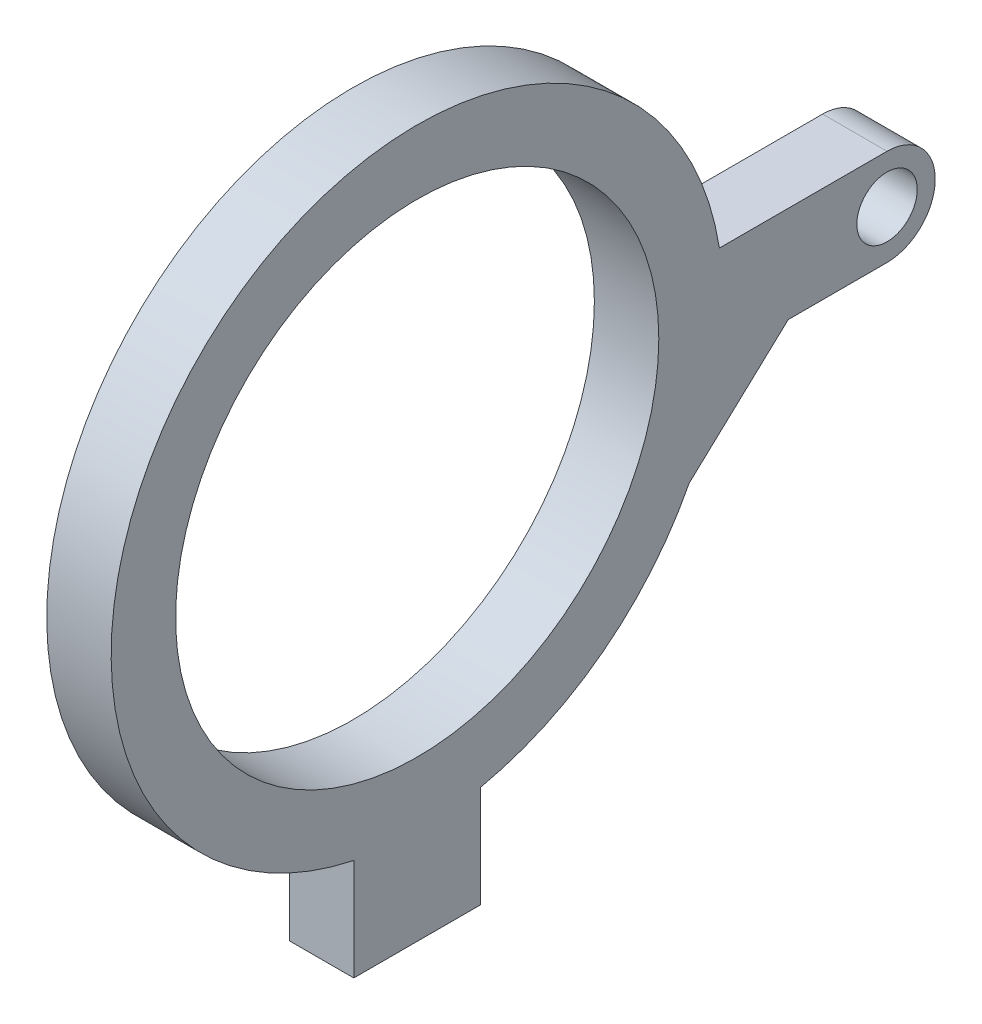
ISO-10303-21;
HEADER;
FILE_DESCRIPTION(('STEP AP214'),'2;1');
FILE_NAME('part.step','',(''),(''),'','','');
FILE_SCHEMA(('AUTOMOTIVE_DESIGN { 1 0 10303 214 1 1 1 1 }'));
ENDSEC;
DATA;
#1=APPLICATION_CONTEXT('core data for automotive mechanical design processes');
#2=APPLICATION_PROTOCOL_DEFINITION('international standard','automotive_design',2000,#1);
#3=PRODUCT_CONTEXT('',#1,'mechanical');
#4=PRODUCT('Part','Part','',(#3));
#5=PRODUCT_RELATED_PRODUCT_CATEGORY('part','',(#4));
#6=PRODUCT_DEFINITION_FORMATION('','',#4);
#7=PRODUCT_DEFINITION_CONTEXT('part definition',#1,'design');
#8=PRODUCT_DEFINITION('design','',#6,#7);
#9=PRODUCT_DEFINITION_SHAPE('','',#8);
#10=(LENGTH_UNIT() NAMED_UNIT(*) SI_UNIT(.MILLI.,.METRE.));
#11=(NAMED_UNIT(*) PLANE_ANGLE_UNIT() SI_UNIT($,.RADIAN.));
#12=(NAMED_UNIT(*) SI_UNIT($,.STERADIAN.) SOLID_ANGLE_UNIT());
#13=UNCERTAINTY_MEASURE_WITH_UNIT(LENGTH_MEASURE(1.E-05),#10,'distance_accuracy_value','');
#14=(GEOMETRIC_REPRESENTATION_CONTEXT(3) GLOBAL_UNCERTAINTY_ASSIGNED_CONTEXT((#13)) GLOBAL_UNIT_ASSIGNED_CONTEXT((#10,
#11,#12)) REPRESENTATION_CONTEXT('',''));
#15=CARTESIAN_POINT('',(0.,0.,0.));
#16=DIRECTION('',(0.,0.,1.));
#17=DIRECTION('',(1.,0.,0.));
#18=AXIS2_PLACEMENT_3D('',#15,#16,#17);
#19=CARTESIAN_POINT('',(25.4,316.3,0.));
#20=DIRECTION('',(-1.,0.,0.));
#21=DIRECTION('',(0.,0.,1.));
#22=AXIS2_PLACEMENT_3D('',#19,#20,#21);
#23=CYLINDRICAL_SURFACE('',#22,241.3);
#24=CARTESIAN_POINT('',(-25.4,316.3,0.));
#25=DIRECTION('',(1.,0.,0.));
#26=DIRECTION('',(0.,0.,-1.));
#27=AXIS2_PLACEMENT_3D('',#24,#25,#26);
#28=CIRCLE('',#27,241.3);
#29=CARTESIAN_POINT('',(-25.4,80.2371058382957,-50.));
#30=VERTEX_POINT('',#29);
#31=CARTESIAN_POINT('',(-25.4,205.638095374301,-214.42861950918));
#32=VERTEX_POINT('',#31);
#33=EDGE_CURVE('E223',#30,#32,#28,.T.);
#34=ORIENTED_EDGE('',*,*,#33,.T.);
#35=DIRECTION('',(-1.,0.,0.));
#36=VECTOR('',#35,1.);
#37=CARTESIAN_POINT('',(25.4,205.638095374301,-214.42861950918));
#38=LINE('',#37,#36);
#39=CARTESIAN_POINT('',(25.4,205.638095374301,-214.42861950918));
#40=VERTEX_POINT('',#39);
#41=EDGE_CURVE('E89',#32,#40,#38,.F.);
#42=ORIENTED_EDGE('',*,*,#41,.T.);
#43=CARTESIAN_POINT('',(25.4,316.3,0.));
#44=DIRECTION('',(1.,0.,0.));
#45=DIRECTION('',(0.,0.,-1.));
#46=AXIS2_PLACEMENT_3D('',#43,#44,#45);
#47=CIRCLE('',#46,241.3);
#48=CARTESIAN_POINT('',(25.4,80.2371058382957,-50.));
#49=VERTEX_POINT('',#48);
#50=EDGE_CURVE('E196',#49,#40,#47,.T.);
#51=ORIENTED_EDGE('',*,*,#50,.F.);
#52=DIRECTION('',(-1.,0.,0.));
#53=VECTOR('',#52,1.);
#54=CARTESIAN_POINT('',(25.4,80.2371058382957,-50.));
#55=LINE('',#54,#53);
#56=EDGE_CURVE('E190',#49,#30,#55,.T.);
#57=ORIENTED_EDGE('',*,*,#56,.T.);
#58=EDGE_LOOP('',(#34,#42,#51,#57));
#59=FACE_BOUND('',#58,.T.);
#60=ADVANCED_FACE('F66',(#59),#23,.T.);
#61=CARTESIAN_POINT('',(25.4,0.,50.));
#62=DIRECTION('',(0.,0.,1.));
#63=DIRECTION('',(0.,-1.,0.));
#64=AXIS2_PLACEMENT_3D('',#61,#62,#63);
#65=PLANE('',#64);
#66=DIRECTION('',(0.,1.,0.));
#67=VECTOR('',#66,1.);
#68=CARTESIAN_POINT('',(-25.4,0.,50.));
#69=LINE('',#68,#67);
#70=CARTESIAN_POINT('',(-25.4,0.,50.));
#71=VERTEX_POINT('',#70);
#72=CARTESIAN_POINT('',(-25.4,80.2371058382957,50.));
#73=VERTEX_POINT('',#72);
#74=EDGE_CURVE('E191',#71,#73,#69,.T.);
#75=ORIENTED_EDGE('',*,*,#74,.F.);
#76=DIRECTION('',(-1.,0.,0.));
#77=VECTOR('',#76,1.);
#78=CARTESIAN_POINT('',(25.4,0.,50.));
#79=LINE('',#78,#77);
#80=CARTESIAN_POINT('',(25.4,0.,50.));
#81=VERTEX_POINT('',#80);
#82=EDGE_CURVE('E208',#81,#71,#79,.T.);
#83=ORIENTED_EDGE('',*,*,#82,.F.);
#84=DIRECTION('',(0.,1.,0.));
#85=VECTOR('',#84,1.);
#86=CARTESIAN_POINT('',(25.4,0.,50.));
#87=LINE('',#86,#85);
#88=CARTESIAN_POINT('',(25.4,80.2371058382957,50.));
#89=VERTEX_POINT('',#88);
#90=EDGE_CURVE('E179',#81,#89,#87,.T.);
#91=ORIENTED_EDGE('',*,*,#90,.T.);
#92=DIRECTION('',(-1.,0.,0.));
#93=VECTOR('',#92,1.);
#94=CARTESIAN_POINT('',(25.4,80.2371058382957,50.));
#95=LINE('',#94,#93);
#96=EDGE_CURVE('E211',#89,#73,#95,.T.);
#97=ORIENTED_EDGE('',*,*,#96,.T.);
#98=EDGE_LOOP('',(#75,#83,#91,#97));
#99=FACE_BOUND('',#98,.T.);
#100=ADVANCED_FACE('F241',(#99),#65,.T.);
#101=CARTESIAN_POINT('',(25.4,0.,0.));
#102=DIRECTION('',(0.,1.,0.));
#103=DIRECTION('',(0.,0.,1.));
#104=AXIS2_PLACEMENT_3D('',#101,#102,#103);
#105=PLANE('',#104);
#106=DIRECTION('',(0.,0.,-1.));
#107=VECTOR('',#106,1.);
#108=CARTESIAN_POINT('',(-25.4,0.,0.));
#109=LINE('',#108,#107);
#110=CARTESIAN_POINT('',(-25.4,0.,-50.));
#111=VERTEX_POINT('',#110);
#112=EDGE_CURVE('E195',#71,#111,#109,.T.);
#113=ORIENTED_EDGE('',*,*,#112,.T.);
#114=DIRECTION('',(-1.,0.,0.));
#115=VECTOR('',#114,1.);
#116=CARTESIAN_POINT('',(25.4,0.,-50.));
#117=LINE('',#116,#115);
#118=CARTESIAN_POINT('',(25.4,0.,-50.));
#119=VERTEX_POINT('',#118);
#120=EDGE_CURVE('E204',#119,#111,#117,.T.);
#121=ORIENTED_EDGE('',*,*,#120,.F.);
#122=DIRECTION('',(0.,0.,-1.));
#123=VECTOR('',#122,1.);
#124=CARTESIAN_POINT('',(25.4,0.,0.));
#125=LINE('',#124,#123);
#126=EDGE_CURVE('E183',#81,#119,#125,.T.);
#127=ORIENTED_EDGE('',*,*,#126,.F.);
#128=ORIENTED_EDGE('',*,*,#82,.T.);
#129=EDGE_LOOP('',(#113,#121,#127,#128));
#130=FACE_BOUND('',#129,.T.);
#131=ADVANCED_FACE('F249',(#130),#105,.F.);
#132=CARTESIAN_POINT('',(25.4,0.,-50.));
#133=DIRECTION('',(0.,0.,1.));
#134=DIRECTION('',(0.,-1.,0.));
#135=AXIS2_PLACEMENT_3D('',#132,#133,#134);
#136=PLANE('',#135);
#137=DIRECTION('',(0.,1.,0.));
#138=VECTOR('',#137,1.);
#139=CARTESIAN_POINT('',(-25.4,0.,-50.));
#140=LINE('',#139,#138);
#141=EDGE_CURVE('E184',#111,#30,#140,.T.);
#142=ORIENTED_EDGE('',*,*,#141,.T.);
#143=ORIENTED_EDGE('',*,*,#56,.F.);
#144=DIRECTION('',(0.,1.,0.));
#145=VECTOR('',#144,1.);
#146=CARTESIAN_POINT('',(25.4,0.,-50.));
#147=LINE('',#146,#145);
#148=EDGE_CURVE('E187',#119,#49,#147,.T.);
#149=ORIENTED_EDGE('',*,*,#148,.F.);
#150=ORIENTED_EDGE('',*,*,#120,.T.);
#151=EDGE_LOOP('',(#142,#143,#149,#150));
#152=FACE_BOUND('',#151,.T.);
#153=ADVANCED_FACE('F253',(#152),#136,.F.);
#154=CARTESIAN_POINT('',(-25.4,0.,0.));
#155=DIRECTION('',(1.,0.,0.));
#156=DIRECTION('',(0.,0.,-1.));
#157=AXIS2_PLACEMENT_3D('',#154,#155,#156);
#158=PLANE('',#157);
#159=ORIENTED_EDGE('',*,*,#74,.T.);
#160=CARTESIAN_POINT('',(-25.4,354.3,-238.289089133347));
#161=VERTEX_POINT('',#160);
#162=EDGE_CURVE('E218',#161,#73,#28,.T.);
#163=ORIENTED_EDGE('',*,*,#162,.F.);
#164=DIRECTION('',(0.,0.,-1.));
#165=VECTOR('',#164,1.);
#166=CARTESIAN_POINT('',(-25.4,354.3,-1.48813502485077E-13));
#167=LINE('',#166,#165);
#168=CARTESIAN_POINT('',(-25.4,354.3,-370.451833459635));
#169=VERTEX_POINT('',#168);
#170=EDGE_CURVE('E256',#161,#169,#167,.T.);
#171=ORIENTED_EDGE('',*,*,#170,.T.);
#172=CARTESIAN_POINT('',(-25.4,316.3,-370.451833459635));
#173=DIRECTION('',(1.,0.,0.));
#174=DIRECTION('',(0.,0.,-1.));
#175=AXIS2_PLACEMENT_3D('',#172,#173,#174);
#176=CIRCLE('',#175,37.9999999999999);
#177=CARTESIAN_POINT('',(-25.4,278.3,-370.451833459635));
#178=VERTEX_POINT('',#177);
#179=EDGE_CURVE('E263',#178,#169,#176,.T.);
#180=ORIENTED_EDGE('',*,*,#179,.F.);
#181=DIRECTION('',(0.,0.,-1.));
#182=VECTOR('',#181,1.);
#183=CARTESIAN_POINT('',(-25.4,278.3,1.16891893145913E-13));
#184=LINE('',#183,#182);
#185=CARTESIAN_POINT('',(-25.4,278.3,-292.514595077201));
#186=VERTEX_POINT('',#185);
#187=EDGE_CURVE('E165',#186,#178,#184,.T.);
#188=ORIENTED_EDGE('',*,*,#187,.F.);
#189=DIRECTION('',(0.,-0.681223492092218,0.732075511010773));
#190=VECTOR('',#189,1.);
#191=CARTESIAN_POINT('',(-25.4,3.27149960574123,3.04425206455043));
#192=LINE('',#191,#190);
#193=EDGE_CURVE('E76',#186,#32,#192,.T.);
#194=ORIENTED_EDGE('',*,*,#193,.T.);
#195=ORIENTED_EDGE('',*,*,#33,.F.);
#196=ORIENTED_EDGE('',*,*,#141,.F.);
#197=ORIENTED_EDGE('',*,*,#112,.F.);
#198=EDGE_LOOP('',(#159,#163,#171,#180,#188,#194,#195,#196,#197));
#199=FACE_BOUND('',#198,.T.);
#200=CARTESIAN_POINT('',(-25.4,316.3,0.));
#201=DIRECTION('',(1.,0.,0.));
#202=DIRECTION('',(0.,0.,-1.));
#203=AXIS2_PLACEMENT_3D('',#200,#201,#202);
#204=CIRCLE('',#203,190.5);
#205=CARTESIAN_POINT('',(-25.4,316.3,-190.5));
#206=VERTEX_POINT('',#205);
#207=EDGE_CURVE('E168',#206,#206,#204,.T.);
#208=ORIENTED_EDGE('',*,*,#207,.T.);
#209=EDGE_LOOP('',(#208));
#210=FACE_BOUND('',#209,.T.);
#211=CARTESIAN_POINT('',(-25.4,316.3,-370.451833459635));
#212=DIRECTION('',(1.,0.,0.));
#213=DIRECTION('',(0.,0.,-1.));
#214=AXIS2_PLACEMENT_3D('',#211,#212,#213);
#215=CIRCLE('',#214,23.8216556260493);
#216=CARTESIAN_POINT('',(-25.4,316.3,-394.273489085684));
#217=VERTEX_POINT('',#216);
#218=EDGE_CURVE('E268',#217,#217,#215,.T.);
#219=ORIENTED_EDGE('',*,*,#218,.T.);
#220=EDGE_LOOP('',(#219));
#221=FACE_BOUND('',#220,.T.);
#222=ADVANCED_FACE('F244',(#199,#210,#221),#158,.F.);
#223=CARTESIAN_POINT('',(25.4,0.,0.));
#224=DIRECTION('',(1.,0.,0.));
#225=DIRECTION('',(0.,0.,-1.));
#226=AXIS2_PLACEMENT_3D('',#223,#224,#225);
#227=PLANE('',#226);
#228=ORIENTED_EDGE('',*,*,#148,.T.);
#229=ORIENTED_EDGE('',*,*,#50,.T.);
#230=DIRECTION('',(0.,0.681223492092218,-0.732075511010773));
#231=VECTOR('',#230,1.);
#232=CARTESIAN_POINT('',(25.4,278.3,-292.514595077201));
#233=LINE('',#232,#231);
#234=CARTESIAN_POINT('',(25.4,278.3,-292.514595077201));
#235=VERTEX_POINT('',#234);
#236=EDGE_CURVE('E12',#40,#235,#233,.T.);
#237=ORIENTED_EDGE('',*,*,#236,.T.);
#238=DIRECTION('',(0.,0.,-1.));
#239=VECTOR('',#238,1.);
#240=CARTESIAN_POINT('',(25.4,278.3,1.16891893145913E-13));
#241=LINE('',#240,#239);
#242=CARTESIAN_POINT('',(25.4,278.3,-370.451833459635));
#243=VERTEX_POINT('',#242);
#244=EDGE_CURVE('E138',#235,#243,#241,.T.);
#245=ORIENTED_EDGE('',*,*,#244,.T.);
#246=CARTESIAN_POINT('',(25.4,316.3,-370.451833459635));
#247=DIRECTION('',(1.,0.,0.));
#248=DIRECTION('',(0.,0.,-1.));
#249=AXIS2_PLACEMENT_3D('',#246,#247,#248);
#250=CIRCLE('',#249,37.9999999999999);
#251=CARTESIAN_POINT('',(25.4,354.3,-370.451833459635));
#252=VERTEX_POINT('',#251);
#253=EDGE_CURVE('E144',#243,#252,#250,.T.);
#254=ORIENTED_EDGE('',*,*,#253,.T.);
#255=DIRECTION('',(0.,0.,-1.));
#256=VECTOR('',#255,1.);
#257=CARTESIAN_POINT('',(25.4,354.3,-1.48813502485077E-13));
#258=LINE('',#257,#256);
#259=CARTESIAN_POINT('',(25.4,354.3,-238.289089133347));
#260=VERTEX_POINT('',#259);
#261=EDGE_CURVE('E162',#260,#252,#258,.T.);
#262=ORIENTED_EDGE('',*,*,#261,.F.);
#263=EDGE_CURVE('E222',#260,#89,#47,.T.);
#264=ORIENTED_EDGE('',*,*,#263,.T.);
#265=ORIENTED_EDGE('',*,*,#90,.F.);
#266=ORIENTED_EDGE('',*,*,#126,.T.);
#267=EDGE_LOOP('',(#228,#229,#237,#245,#254,#262,#264,#265,#266));
#268=FACE_BOUND('',#267,.T.);
#269=CARTESIAN_POINT('',(25.4,316.3,0.));
#270=DIRECTION('',(1.,0.,0.));
#271=DIRECTION('',(0.,0.,-1.));
#272=AXIS2_PLACEMENT_3D('',#269,#270,#271);
#273=CIRCLE('',#272,190.5);
#274=CARTESIAN_POINT('',(25.4,316.3,-190.5));
#275=VERTEX_POINT('',#274);
#276=EDGE_CURVE('E173',#275,#275,#273,.T.);
#277=ORIENTED_EDGE('',*,*,#276,.F.);
#278=EDGE_LOOP('',(#277));
#279=FACE_BOUND('',#278,.T.);
#280=CARTESIAN_POINT('',(25.4,316.3,-370.451833459635));
#281=DIRECTION('',(1.,0.,0.));
#282=DIRECTION('',(0.,0.,-1.));
#283=AXIS2_PLACEMENT_3D('',#280,#281,#282);
#284=CIRCLE('',#283,23.8216556260493);
#285=CARTESIAN_POINT('',(25.4,316.3,-394.273489085684));
#286=VERTEX_POINT('',#285);
#287=EDGE_CURVE('E152',#286,#286,#284,.T.);
#288=ORIENTED_EDGE('',*,*,#287,.F.);
#289=EDGE_LOOP('',(#288));
#290=FACE_BOUND('',#289,.T.);
#291=ADVANCED_FACE('F141',(#268,#279,#290),#227,.T.);
#292=CARTESIAN_POINT('',(25.4,316.3,0.));
#293=DIRECTION('',(-1.,0.,0.));
#294=DIRECTION('',(0.,0.,1.));
#295=AXIS2_PLACEMENT_3D('',#292,#293,#294);
#296=CYLINDRICAL_SURFACE('',#295,190.5);
#297=ORIENTED_EDGE('',*,*,#276,.T.);
#298=EDGE_LOOP('',(#297));
#299=FACE_BOUND('',#298,.T.);
#300=ORIENTED_EDGE('',*,*,#207,.F.);
#301=EDGE_LOOP('',(#300));
#302=FACE_BOUND('',#301,.T.);
#303=ADVANCED_FACE('F280',(#299,#302),#296,.F.);
#304=ORIENTED_EDGE('',*,*,#263,.F.);
#305=DIRECTION('',(-1.,0.,0.));
#306=VECTOR('',#305,1.);
#307=CARTESIAN_POINT('',(25.4,354.3,-238.289089133347));
#308=LINE('',#307,#306);
#309=EDGE_CURVE('E175',#260,#161,#308,.T.);
#310=ORIENTED_EDGE('',*,*,#309,.T.);
#311=ORIENTED_EDGE('',*,*,#162,.T.);
#312=ORIENTED_EDGE('',*,*,#96,.F.);
#313=EDGE_LOOP('',(#304,#310,#311,#312));
#314=FACE_BOUND('',#313,.T.);
#315=ADVANCED_FACE('F235',(#314),#23,.T.);
#316=CARTESIAN_POINT('',(25.4,278.3,1.16891893145913E-13));
#317=DIRECTION('',(0.,1.,0.));
#318=DIRECTION('',(0.,0.,1.));
#319=AXIS2_PLACEMENT_3D('',#316,#317,#318);
#320=PLANE('',#319);
#321=ORIENTED_EDGE('',*,*,#244,.F.);
#322=DIRECTION('',(-1.,0.,0.));
#323=VECTOR('',#322,1.);
#324=CARTESIAN_POINT('',(-25.4,278.3,-292.514595077201));
#325=LINE('',#324,#323);
#326=EDGE_CURVE('E215',#235,#186,#325,.T.);
#327=ORIENTED_EDGE('',*,*,#326,.T.);
#328=ORIENTED_EDGE('',*,*,#187,.T.);
#329=DIRECTION('',(-1.,0.,0.));
#330=VECTOR('',#329,1.);
#331=CARTESIAN_POINT('',(25.4,278.3,-370.451833459635));
#332=LINE('',#331,#330);
#333=EDGE_CURVE('E158',#243,#178,#332,.T.);
#334=ORIENTED_EDGE('',*,*,#333,.F.);
#335=EDGE_LOOP('',(#321,#327,#328,#334));
#336=FACE_BOUND('',#335,.T.);
#337=ADVANCED_FACE('F164',(#336),#320,.F.);
#338=CARTESIAN_POINT('',(25.4,316.3,-370.451833459635));
#339=DIRECTION('',(-1.,0.,0.));
#340=DIRECTION('',(0.,0.,1.));
#341=AXIS2_PLACEMENT_3D('',#338,#339,#340);
#342=CYLINDRICAL_SURFACE('',#341,37.9999999999999);
#343=ORIENTED_EDGE('',*,*,#179,.T.);
#344=DIRECTION('',(-1.,0.,0.));
#345=VECTOR('',#344,1.);
#346=CARTESIAN_POINT('',(25.4,354.3,-370.451833459635));
#347=LINE('',#346,#345);
#348=EDGE_CURVE('E159',#252,#169,#347,.T.);
#349=ORIENTED_EDGE('',*,*,#348,.F.);
#350=ORIENTED_EDGE('',*,*,#253,.F.);
#351=ORIENTED_EDGE('',*,*,#333,.T.);
#352=EDGE_LOOP('',(#343,#349,#350,#351));
#353=FACE_BOUND('',#352,.T.);
#354=ADVANCED_FACE('F157',(#353),#342,.T.);
#355=CARTESIAN_POINT('',(25.4,316.3,-370.451833459635));
#356=DIRECTION('',(-1.,0.,0.));
#357=DIRECTION('',(0.,0.,1.));
#358=AXIS2_PLACEMENT_3D('',#355,#356,#357);
#359=CYLINDRICAL_SURFACE('',#358,23.8216556260493);
#360=ORIENTED_EDGE('',*,*,#287,.T.);
#361=EDGE_LOOP('',(#360));
#362=FACE_BOUND('',#361,.T.);
#363=ORIENTED_EDGE('',*,*,#218,.F.);
#364=EDGE_LOOP('',(#363));
#365=FACE_BOUND('',#364,.T.);
#366=ADVANCED_FACE('F276',(#362,#365),#359,.F.);
#367=CARTESIAN_POINT('',(25.4,354.3,-1.48813502485077E-13));
#368=DIRECTION('',(0.,1.,0.));
#369=DIRECTION('',(0.,0.,1.));
#370=AXIS2_PLACEMENT_3D('',#367,#368,#369);
#371=PLANE('',#370);
#372=ORIENTED_EDGE('',*,*,#170,.F.);
#373=ORIENTED_EDGE('',*,*,#309,.F.);
#374=ORIENTED_EDGE('',*,*,#261,.T.);
#375=ORIENTED_EDGE('',*,*,#348,.T.);
#376=EDGE_LOOP('',(#372,#373,#374,#375));
#377=FACE_BOUND('',#376,.T.);
#378=ADVANCED_FACE('F255',(#377),#371,.T.);
#379=CARTESIAN_POINT('',(25.4,278.3,-292.514595077201));
#380=DIRECTION('',(0.,0.732075511010773,0.681223492092218));
#381=DIRECTION('',(-1.,0.,0.));
#382=AXIS2_PLACEMENT_3D('',#379,#380,#381);
#383=PLANE('',#382);
#384=ORIENTED_EDGE('',*,*,#236,.F.);
#385=ORIENTED_EDGE('',*,*,#41,.F.);
#386=ORIENTED_EDGE('',*,*,#193,.F.);
#387=ORIENTED_EDGE('',*,*,#326,.F.);
#388=EDGE_LOOP('',(#384,#385,#386,#387));
#389=FACE_BOUND('',#388,.T.);
#390=ADVANCED_FACE('F69',(#389),#383,.F.);
#391=CLOSED_SHELL('',(#60,#100,#131,#153,#222,#291,#303,#315,#337,#354,#366,#378,#390));
#392=MANIFOLD_SOLID_BREP('B2',#391);
#393=ADVANCED_BREP_SHAPE_REPRESENTATION('',(#18,#392),#14);
#394=SHAPE_DEFINITION_REPRESENTATION(#9,#393);
ENDSEC;
END-ISO-10303-21;
